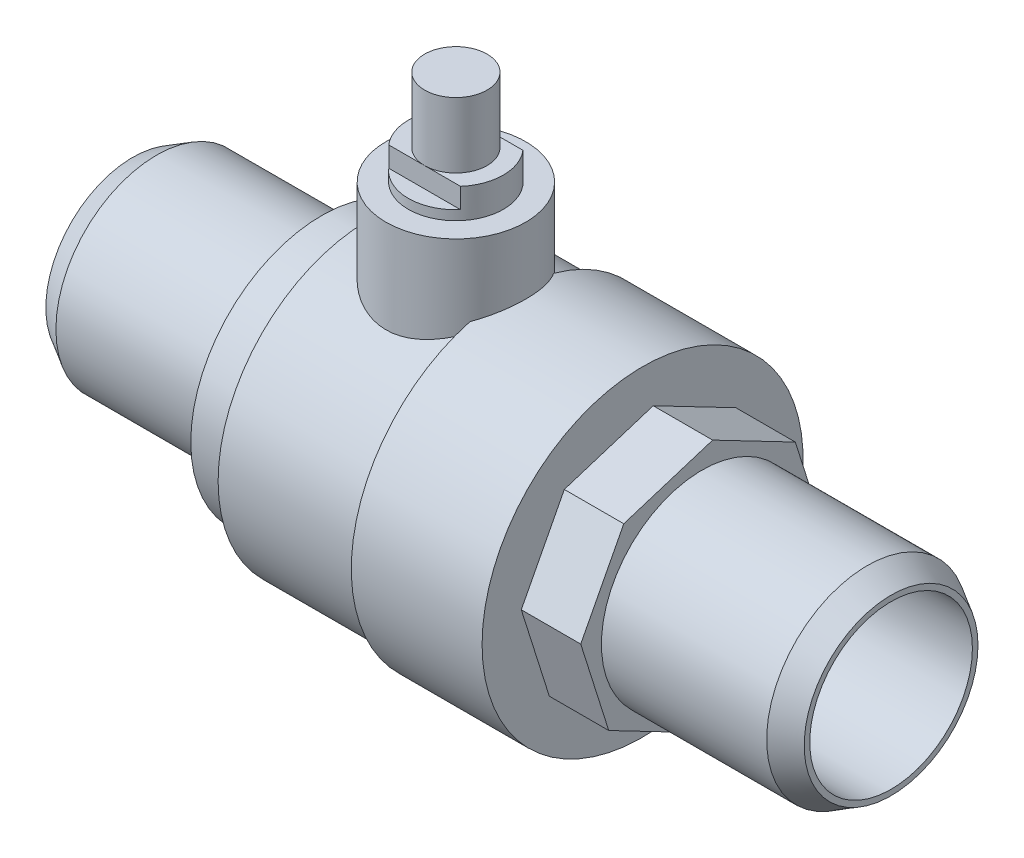
ISO-10303-21;
HEADER;
FILE_DESCRIPTION(('STEP AP214'),'2;1');
FILE_NAME('part.step','',(''),(''),'','','');
FILE_SCHEMA(('AUTOMOTIVE_DESIGN { 1 0 10303 214 1 1 1 1 }'));
ENDSEC;
DATA;
#1=APPLICATION_CONTEXT('core data for automotive mechanical design processes');
#2=APPLICATION_PROTOCOL_DEFINITION('international standard','automotive_design',2000,#1);
#3=PRODUCT_CONTEXT('',#1,'mechanical');
#4=PRODUCT('Part','Part','',(#3));
#5=PRODUCT_RELATED_PRODUCT_CATEGORY('part','',(#4));
#6=PRODUCT_DEFINITION_FORMATION('','',#4);
#7=PRODUCT_DEFINITION_CONTEXT('part definition',#1,'design');
#8=PRODUCT_DEFINITION('design','',#6,#7);
#9=PRODUCT_DEFINITION_SHAPE('','',#8);
#10=(LENGTH_UNIT() NAMED_UNIT(*) SI_UNIT(.MILLI.,.METRE.));
#11=(NAMED_UNIT(*) PLANE_ANGLE_UNIT() SI_UNIT($,.RADIAN.));
#12=(NAMED_UNIT(*) SI_UNIT($,.STERADIAN.) SOLID_ANGLE_UNIT());
#13=UNCERTAINTY_MEASURE_WITH_UNIT(LENGTH_MEASURE(1.E-05),#10,'distance_accuracy_value','');
#14=(GEOMETRIC_REPRESENTATION_CONTEXT(3) GLOBAL_UNCERTAINTY_ASSIGNED_CONTEXT((#13)) GLOBAL_UNIT_ASSIGNED_CONTEXT((#10,
#11,#12)) REPRESENTATION_CONTEXT('',''));
#15=CARTESIAN_POINT('',(0.,0.,0.));
#16=DIRECTION('',(0.,0.,1.));
#17=DIRECTION('',(1.,0.,0.));
#18=AXIS2_PLACEMENT_3D('',#15,#16,#17);
#19=CARTESIAN_POINT('',(-4.715,21.6,0.));
#20=DIRECTION('',(0.,1.,0.));
#21=DIRECTION('',(0.,0.,1.));
#22=AXIS2_PLACEMENT_3D('',#19,#20,#21);
#23=PLANE('',#22);
#24=CARTESIAN_POINT('',(-4.715,21.6,0.));
#25=DIRECTION('',(0.,1.,0.));
#26=DIRECTION('',(0.,0.,1.));
#27=AXIS2_PLACEMENT_3D('',#24,#25,#26);
#28=CIRCLE('',#27,2.625);
#29=CARTESIAN_POINT('',(-4.715,21.6,2.625));
#30=VERTEX_POINT('',#29);
#31=CARTESIAN_POINT('',(-4.715,21.6,-2.625));
#32=VERTEX_POINT('',#31);
#33=EDGE_CURVE('E162',#30,#32,#28,.T.);
#34=ORIENTED_EDGE('',*,*,#33,.F.);
#35=DIRECTION('',(1.,0.,0.));
#36=VECTOR('',#35,1.);
#37=CARTESIAN_POINT('',(-4.715,21.6,2.625));
#38=LINE('',#37,#36);
#39=CARTESIAN_POINT('',(-1.69682588308759,21.6,2.625));
#40=VERTEX_POINT('',#39);
#41=EDGE_CURVE('E148',#30,#40,#38,.T.);
#42=ORIENTED_EDGE('',*,*,#41,.T.);
#43=CARTESIAN_POINT('',(-4.715,21.6,0.));
#44=DIRECTION('',(0.,1.,0.));
#45=DIRECTION('',(0.,0.,1.));
#46=AXIS2_PLACEMENT_3D('',#43,#44,#45);
#47=CIRCLE('',#46,4.);
#48=CARTESIAN_POINT('',(-1.69682588308759,21.6,-2.625));
#49=VERTEX_POINT('',#48);
#50=EDGE_CURVE('E189',#40,#49,#47,.T.);
#51=ORIENTED_EDGE('',*,*,#50,.T.);
#52=DIRECTION('',(-1.,0.,0.));
#53=VECTOR('',#52,1.);
#54=CARTESIAN_POINT('',(-4.715,21.6,-2.625));
#55=LINE('',#54,#53);
#56=EDGE_CURVE('E159',#49,#32,#55,.T.);
#57=ORIENTED_EDGE('',*,*,#56,.T.);
#58=EDGE_LOOP('',(#34,#42,#51,#57));
#59=FACE_BOUND('',#58,.T.);
#60=ADVANCED_FACE('F36',(#59),#23,.T.);
#61=CARTESIAN_POINT('',(-4.715,21.6,0.));
#62=DIRECTION('',(0.,-1.,0.));
#63=DIRECTION('',(0.,0.,-1.));
#64=AXIS2_PLACEMENT_3D('',#61,#62,#63);
#65=CYLINDRICAL_SURFACE('',#64,4.);
#66=CARTESIAN_POINT('',(-4.715,19.1,0.));
#67=DIRECTION('',(0.,1.,0.));
#68=DIRECTION('',(0.,0.,1.));
#69=AXIS2_PLACEMENT_3D('',#66,#67,#68);
#70=CIRCLE('',#69,4.);
#71=CARTESIAN_POINT('',(-4.715,19.1,4.));
#72=VERTEX_POINT('',#71);
#73=EDGE_CURVE('E192',#72,#72,#70,.T.);
#74=ORIENTED_EDGE('',*,*,#73,.T.);
#75=EDGE_LOOP('',(#74));
#76=FACE_BOUND('',#75,.T.);
#77=DIRECTION('',(0.,-1.,0.));
#78=VECTOR('',#77,1.);
#79=CARTESIAN_POINT('',(-7.73317411691241,21.6,2.625));
#80=LINE('',#79,#78);
#81=CARTESIAN_POINT('',(-7.73317411691241,21.6,2.625));
#82=VERTEX_POINT('',#81);
#83=CARTESIAN_POINT('',(-7.73317411691241,19.9,2.625));
#84=VERTEX_POINT('',#83);
#85=EDGE_CURVE('E187',#82,#84,#80,.T.);
#86=ORIENTED_EDGE('',*,*,#85,.F.);
#87=CARTESIAN_POINT('',(-7.73317411691241,21.6,-2.625));
#88=VERTEX_POINT('',#87);
#89=EDGE_CURVE('E144',#88,#82,#47,.T.);
#90=ORIENTED_EDGE('',*,*,#89,.F.);
#91=DIRECTION('',(0.,-1.,0.));
#92=VECTOR('',#91,1.);
#93=CARTESIAN_POINT('',(-7.73317411691241,21.6,-2.625));
#94=LINE('',#93,#92);
#95=CARTESIAN_POINT('',(-7.73317411691241,19.9,-2.625));
#96=VERTEX_POINT('',#95);
#97=EDGE_CURVE('E182',#96,#88,#94,.F.);
#98=ORIENTED_EDGE('',*,*,#97,.F.);
#99=CARTESIAN_POINT('',(-4.715,19.9,0.));
#100=DIRECTION('',(0.,1.,0.));
#101=DIRECTION('',(0.,0.,1.));
#102=AXIS2_PLACEMENT_3D('',#99,#100,#101);
#103=CIRCLE('',#102,4.);
#104=CARTESIAN_POINT('',(-1.69682588308759,19.9,-2.625));
#105=VERTEX_POINT('',#104);
#106=EDGE_CURVE('E147',#105,#96,#103,.T.);
#107=ORIENTED_EDGE('',*,*,#106,.F.);
#108=DIRECTION('',(0.,-1.,0.));
#109=VECTOR('',#108,1.);
#110=CARTESIAN_POINT('',(-1.69682588308759,21.6,-2.625));
#111=LINE('',#110,#109);
#112=EDGE_CURVE('E184',#49,#105,#111,.T.);
#113=ORIENTED_EDGE('',*,*,#112,.F.);
#114=ORIENTED_EDGE('',*,*,#50,.F.);
#115=DIRECTION('',(0.,-1.,0.));
#116=VECTOR('',#115,1.);
#117=CARTESIAN_POINT('',(-1.69682588308759,21.6,2.625));
#118=LINE('',#117,#116);
#119=CARTESIAN_POINT('',(-1.69682588308759,19.9,2.625));
#120=VERTEX_POINT('',#119);
#121=EDGE_CURVE('E155',#120,#40,#118,.F.);
#122=ORIENTED_EDGE('',*,*,#121,.F.);
#123=EDGE_CURVE('E169',#84,#120,#103,.T.);
#124=ORIENTED_EDGE('',*,*,#123,.F.);
#125=EDGE_LOOP('',(#86,#90,#98,#107,#113,#114,#122,#124));
#126=FACE_BOUND('',#125,.T.);
#127=ADVANCED_FACE('F269',(#76,#126),#65,.T.);
#128=EDGE_CURVE('E52',#32,#30,#28,.T.);
#129=ORIENTED_EDGE('',*,*,#128,.F.);
#130=EDGE_CURVE('E56',#32,#88,#55,.T.);
#131=ORIENTED_EDGE('',*,*,#130,.T.);
#132=ORIENTED_EDGE('',*,*,#89,.T.);
#133=EDGE_CURVE('E140',#82,#30,#38,.T.);
#134=ORIENTED_EDGE('',*,*,#133,.T.);
#135=EDGE_LOOP('',(#129,#131,#132,#134));
#136=FACE_BOUND('',#135,.T.);
#137=ADVANCED_FACE('F142',(#136),#23,.T.);
#138=CARTESIAN_POINT('',(-0.00999999999999959,0.,0.));
#139=DIRECTION('',(1.,0.,0.));
#140=DIRECTION('',(0.,0.,-1.));
#141=AXIS2_PLACEMENT_3D('',#138,#139,#140);
#142=CYLINDRICAL_SURFACE('',#141,13.5);
#143=CARTESIAN_POINT('',(10.99,0.,0.));
#144=DIRECTION('',(-1.,0.,0.));
#145=DIRECTION('',(0.,0.,1.));
#146=AXIS2_PLACEMENT_3D('',#143,#144,#145);
#147=CIRCLE('',#146,13.5);
#148=CARTESIAN_POINT('',(10.99,0.,13.5));
#149=VERTEX_POINT('',#148);
#150=EDGE_CURVE('E286',#149,#149,#147,.T.);
#151=ORIENTED_EDGE('',*,*,#150,.T.);
#152=EDGE_LOOP('',(#151));
#153=FACE_BOUND('',#152,.T.);
#154=CARTESIAN_POINT('',(-0.00999999999999959,13.0334722925244,3.51832346437902));
#155=CARTESIAN_POINT('',(0.0842090049769577,13.0674896501867,3.39235443396426));
#156=CARTESIAN_POINT('',(0.173473865123659,13.1005940665465,3.26241761418438));
#157=CARTESIAN_POINT('',(0.341554162434968,13.1642318881376,2.99529103325605));
#158=CARTESIAN_POINT('',(0.42036586790057,13.1947643737967,2.85809870626161));
#159=CARTESIAN_POINT('',(0.567103087805311,13.2525636479501,2.57686594420769));
#160=CARTESIAN_POINT('',(0.634999490305637,13.2798216558372,2.43280848220463));
#161=CARTESIAN_POINT('',(0.759071309045436,13.3302893674388,2.13906108417161));
#162=CARTESIAN_POINT('',(0.81524815683983,13.3534995655403,1.98937183870914));
#163=CARTESIAN_POINT('',(0.915496394897774,13.395326930808,1.6849010459959));
#164=CARTESIAN_POINT('',(0.959534428024665,13.4139314276322,1.53010675008761));
#165=CARTESIAN_POINT('',(1.03484120384337,13.4459616953606,1.21691735286865));
#166=CARTESIAN_POINT('',(1.06611043893269,13.4593876659609,1.05852239065759));
#167=CARTESIAN_POINT('',(1.11548306785242,13.4806680844181,0.739642327041597));
#168=CARTESIAN_POINT('',(1.13361234936406,13.488533486673,0.579161972982386));
#169=CARTESIAN_POINT('',(1.15659240656238,13.4985133973601,0.257079905606061));
#170=CARTESIAN_POINT('',(1.16144393496519,13.500628231792,0.0954782563759108));
#171=CARTESIAN_POINT('',(1.15790310699269,13.4990876113684,-0.219602012561963));
#172=CARTESIAN_POINT('',(1.15014973707764,13.4957105569392,-0.373089634540998));
#173=CARTESIAN_POINT('',(1.1226671805155,13.4837895089721,-0.678849620625366));
#174=CARTESIAN_POINT('',(1.10293311034488,13.4752434084543,-0.831121463503043));
#175=CARTESIAN_POINT('',(1.05165475173216,13.4531835037983,-1.13352204801818));
#176=CARTESIAN_POINT('',(1.02009338271723,13.4396625156158,-1.28364736261266));
#177=CARTESIAN_POINT('',(0.945478445409897,13.4079920800935,-1.58051791025914));
#178=CARTESIAN_POINT('',(0.902424221982664,13.3898423689023,-1.7272629501049));
#179=CARTESIAN_POINT('',(0.803820397667253,13.3487709561276,-2.02061314076969));
#180=CARTESIAN_POINT('',(0.747945719761866,13.3257265326326,-2.16709175484948));
#181=CARTESIAN_POINT('',(0.624952698662875,13.2757793315217,-2.45458388963828));
#182=CARTESIAN_POINT('',(0.557832788991176,13.2488760164313,-2.59559664557027));
#183=CARTESIAN_POINT('',(0.413061355079574,13.1919276596294,-2.87102032870646));
#184=CARTESIAN_POINT('',(0.335433638681942,13.1618897543109,-3.00544527043807));
#185=CARTESIAN_POINT('',(0.170121600484586,13.0993508461218,-3.26729273426234));
#186=CARTESIAN_POINT('',(0.0824408978463979,13.0668507310885,-3.39471775210353));
#187=CARTESIAN_POINT('',(-0.00999999999999942,13.0334722925244,-3.51832346437902));
#188=B_SPLINE_CURVE_WITH_KNOTS('',3,(#154,#155,#156,#157,#158,#159,#160,#161,#162,#163,#164,
#165,#166,#167,#168,#169,#170,#171,#172,#173,#174,#175,#176,#177,#178,#179,#180,#181,#182,#183,
#184,#185,#186,#187),.UNSPECIFIED.,.F.,.F.,(4,2,2,2,2,2,2,2,2,2,2,2,2,2,2,2,4),(0.,
0.482712728291856,0.965597320284249,1.44974916919056,1.93384184380876,2.41925182283332,
2.9046430814395,3.389075427539,3.8734803105891,4.33408544035974,4.79487844626508,
5.25633949410212,5.71782685252939,6.19264750298032,6.66753435175786,7.14136270440398,
7.61502100723786),.UNSPECIFIED.);
#189=CARTESIAN_POINT('',(-0.00999999999999959,13.0334722925244,3.51832346437902));
#190=VERTEX_POINT('',#189);
#191=CARTESIAN_POINT('',(-0.00999999999999959,13.0334722925244,-3.51832346437902));
#192=VERTEX_POINT('',#191);
#193=EDGE_CURVE('E203',#190,#192,#188,.T.);
#194=ORIENTED_EDGE('',*,*,#193,.F.);
#195=CARTESIAN_POINT('',(-0.00999999999999959,0.,0.));
#196=DIRECTION('',(-1.,0.,0.));
#197=DIRECTION('',(0.,0.,1.));
#198=AXIS2_PLACEMENT_3D('',#195,#196,#197);
#199=CIRCLE('',#198,13.5);
#200=EDGE_CURVE('E289',#192,#190,#199,.T.);
#201=ORIENTED_EDGE('',*,*,#200,.F.);
#202=EDGE_LOOP('',(#194,#201));
#203=FACE_BOUND('',#202,.T.);
#204=ADVANCED_FACE('F215',(#153,#203),#142,.T.);
#205=CARTESIAN_POINT('',(-0.00999999999999959,0.,0.));
#206=DIRECTION('',(-1.,0.,0.));
#207=DIRECTION('',(0.,0.,1.));
#208=AXIS2_PLACEMENT_3D('',#205,#206,#207);
#209=PLANE('',#208);
#210=CARTESIAN_POINT('',(-0.00999999999999959,0.,0.));
#211=DIRECTION('',(-1.,0.,0.));
#212=DIRECTION('',(0.,0.,1.));
#213=AXIS2_PLACEMENT_3D('',#210,#211,#212);
#214=CIRCLE('',#213,12.7);
#215=CARTESIAN_POINT('',(-0.00999999999999959,12.2029258786571,-3.51832346437902));
#216=VERTEX_POINT('',#215);
#217=CARTESIAN_POINT('',(-0.00999999999999959,12.2029258786571,3.51832346437902));
#218=VERTEX_POINT('',#217);
#219=EDGE_CURVE('E297',#216,#218,#214,.T.);
#220=ORIENTED_EDGE('',*,*,#219,.F.);
#221=DIRECTION('',(0.,-1.,0.));
#222=VECTOR('',#221,1.);
#223=CARTESIAN_POINT('',(-0.00999999999999959,19.1,-3.51832346437902));
#224=LINE('',#223,#222);
#225=EDGE_CURVE('E201',#216,#192,#224,.F.);
#226=ORIENTED_EDGE('',*,*,#225,.T.);
#227=ORIENTED_EDGE('',*,*,#200,.T.);
#228=DIRECTION('',(0.,-1.,0.));
#229=VECTOR('',#228,1.);
#230=CARTESIAN_POINT('',(-0.00999999999999959,19.1,3.51832346437902));
#231=LINE('',#230,#229);
#232=EDGE_CURVE('E198',#190,#218,#231,.T.);
#233=ORIENTED_EDGE('',*,*,#232,.T.);
#234=EDGE_LOOP('',(#220,#226,#227,#233));
#235=FACE_BOUND('',#234,.T.);
#236=ADVANCED_FACE('F249',(#235),#209,.T.);
#237=CARTESIAN_POINT('',(-12.01,0.,0.));
#238=DIRECTION('',(1.,0.,0.));
#239=DIRECTION('',(0.,0.,-1.));
#240=AXIS2_PLACEMENT_3D('',#237,#238,#239);
#241=CYLINDRICAL_SURFACE('',#240,12.7);
#242=CARTESIAN_POINT('',(-12.01,0.,0.));
#243=DIRECTION('',(-1.,0.,0.));
#244=DIRECTION('',(0.,0.,1.));
#245=AXIS2_PLACEMENT_3D('',#242,#243,#244);
#246=CIRCLE('',#245,12.7);
#247=CARTESIAN_POINT('',(-12.01,0.,12.7));
#248=VERTEX_POINT('',#247);
#249=EDGE_CURVE('E298',#248,#248,#246,.T.);
#250=ORIENTED_EDGE('',*,*,#249,.F.);
#251=EDGE_LOOP('',(#250));
#252=FACE_BOUND('',#251,.T.);
#253=CARTESIAN_POINT('',(-0.00999999999999959,12.2029258786571,-3.51832346437902));
#254=CARTESIAN_POINT('',(-0.110548594807292,12.1641669182533,-3.65277213936879));
#255=CARTESIAN_POINT('',(-0.216642378817668,12.1243094096603,-3.78264458001596));
#256=CARTESIAN_POINT('',(-0.439337427258175,12.043456940642,-4.03266537142814));
#257=CARTESIAN_POINT('',(-0.555938711979185,12.0024619780203,-4.15281370341421));
#258=CARTESIAN_POINT('',(-0.92129120792452,11.8791370369348,-4.49844094417245));
#259=CARTESIAN_POINT('',(-1.18503699789073,11.7966897370434,-4.70836314660586));
#260=CARTESIAN_POINT('',(-1.74691591942007,11.6409320836049,-5.08131937956054));
#261=CARTESIAN_POINT('',(-2.04508908644483,11.5676325782703,-5.24429803441645));
#262=CARTESIAN_POINT('',(-2.51207556840235,11.4718766264648,-5.44900716313044));
#263=CARTESIAN_POINT('',(-2.67096699235351,11.4423313162767,-5.5106025856715));
#264=CARTESIAN_POINT('',(-2.99441727952624,11.3890031075838,-5.61999346422932));
#265=CARTESIAN_POINT('',(-3.15897567443825,11.3652197342205,-5.66779005751119));
#266=CARTESIAN_POINT('',(-3.48330339845309,11.3255010002015,-5.74672696052976));
#267=CARTESIAN_POINT('',(-3.64284248597849,11.3092075827731,-5.77863521017378));
#268=CARTESIAN_POINT('',(-3.96454431885749,11.2832561801997,-5.82914585007749));
#269=CARTESIAN_POINT('',(-4.12670681215733,11.2735975614212,-5.84774951095316));
#270=CARTESIAN_POINT('',(-4.45224692748032,11.2613038081456,-5.87138954715816));
#271=CARTESIAN_POINT('',(-4.61562426368574,11.2586670709531,-5.87642901842208));
#272=CARTESIAN_POINT('',(-4.94218439611731,11.2605210819185,-5.87287585237765));
#273=CARTESIAN_POINT('',(-5.10536720377793,11.2650113881409,-5.86428406032039));
#274=CARTESIAN_POINT('',(-5.41485193702559,11.2801843194109,-5.83503878693275));
#275=CARTESIAN_POINT('',(-5.56130061155865,11.2902461244553,-5.81559320542977));
#276=CARTESIAN_POINT('',(-5.85190820158059,11.3157401889006,-5.76583083509889));
#277=CARTESIAN_POINT('',(-5.99606638245782,11.3311741363078,-5.73551062921266));
#278=CARTESIAN_POINT('',(-6.28109832773566,11.3669281386523,-5.66432064658729));
#279=CARTESIAN_POINT('',(-6.4219728438453,11.3872470630087,-5.62345331071901));
#280=CARTESIAN_POINT('',(-6.69968355728552,11.4321706981511,-5.53155332482791));
#281=CARTESIAN_POINT('',(-6.8365181614466,11.4567770740072,-5.48051672437029));
#282=CARTESIAN_POINT('',(-7.24873220968141,11.5377725260792,-5.30906523044976));
#283=CARTESIAN_POINT('',(-7.51648602828107,11.6001044310782,-5.17264292370361));
#284=CARTESIAN_POINT('',(-8.02647768569675,11.733687054927,-4.86200579029639));
#285=CARTESIAN_POINT('',(-8.26870337651138,11.804941984976,-4.68777309046908));
#286=CARTESIAN_POINT('',(-8.74790880011808,11.9575002579965,-4.28478547361512));
#287=CARTESIAN_POINT('',(-8.98159890584744,12.0390670460731,-4.05220519150853));
#288=CARTESIAN_POINT('',(-9.40777799168936,12.1966077819357,-3.54990409003812));
#289=CARTESIAN_POINT('',(-9.60025518313359,12.2725801254034,-3.28017268001098));
#290=CARTESIAN_POINT('',(-9.85585816452821,12.3772616839151,-2.84889148483661));
#291=CARTESIAN_POINT('',(-9.93634112564312,12.4109755823173,-2.69859550005496));
#292=CARTESIAN_POINT('',(-10.0842344704794,12.4739152446686,-2.3908257418733));
#293=CARTESIAN_POINT('',(-10.1516504077337,12.5031429141773,-2.2333550530485));
#294=CARTESIAN_POINT('',(-10.2726799013604,12.5562425330116,-1.91238988155526));
#295=CARTESIAN_POINT('',(-10.3262983661599,12.5801163865583,-1.74889756479732));
#296=CARTESIAN_POINT('',(-10.419126991878,12.6217952678041,-1.41711711757746));
#297=CARTESIAN_POINT('',(-10.4583385615476,12.6396008888614,-1.2488294577541));
#298=CARTESIAN_POINT('',(-10.5193516181522,12.6674464091839,-0.922238093812368));
#299=CARTESIAN_POINT('',(-10.5422770977891,12.6779857235478,-0.764186122953552));
#300=CARTESIAN_POINT('',(-10.5751875946665,12.6931461183262,-0.446462076686936));
#301=CARTESIAN_POINT('',(-10.5851734740665,12.6977675930431,-0.286790109933228));
#302=CARTESIAN_POINT('',(-10.5920821846774,12.7009629955518,0.0328521465153815));
#303=CARTESIAN_POINT('',(-10.589008568495,12.6995385680251,0.192822343247483));
#304=CARTESIAN_POINT('',(-10.5698444140534,12.6906857769125,0.511810691635123));
#305=CARTESIAN_POINT('',(-10.5537542036093,12.6832575645282,0.670828867165139));
#306=CARTESIAN_POINT('',(-10.5100774233596,12.6632123380329,0.977366818647544));
#307=CARTESIAN_POINT('',(-10.4832218749976,12.6509258384536,1.12501322469448));
#308=CARTESIAN_POINT('',(-10.4184216176295,12.6215118046091,1.41740601336874));
#309=CARTESIAN_POINT('',(-10.3804733409434,12.6043827129118,1.56215144694631));
#310=CARTESIAN_POINT('',(-10.2938619449516,12.5656903109779,1.84774942934955));
#311=CARTESIAN_POINT('',(-10.2452018185142,12.5441282394177,1.988603053191));
#312=CARTESIAN_POINT('',(-10.1375930787599,12.4970621490617,2.26566350672443));
#313=CARTESIAN_POINT('',(-10.0786405346506,12.4715566246435,2.40186853721995));
#314=CARTESIAN_POINT('',(-9.88227500452301,12.387922880138,2.81228645554904));
#315=CARTESIAN_POINT('',(-9.72854698255835,12.3241554098885,3.07776739837333));
#316=CARTESIAN_POINT('',(-9.38316358516594,12.1877400609405,3.58008365683265));
#317=CARTESIAN_POINT('',(-9.19149028150075,12.1150879907079,3.81690534610461));
#318=CARTESIAN_POINT('',(-8.75630325734514,11.9608338576033,4.27694318001063));
#319=CARTESIAN_POINT('',(-8.50973624991333,11.8790018519769,4.49720100086377));
#320=CARTESIAN_POINT('',(-7.98171014490996,11.7210304653922,4.89420329863303));
#321=CARTESIAN_POINT('',(-7.70023811277061,11.644893211563,5.07093157215979));
#322=CARTESIAN_POINT('',(-7.25351509110038,11.5410891150359,5.30099584811714));
#323=CARTESIAN_POINT('',(-7.09863458002546,11.5079093891222,5.3724433074084));
#324=CARTESIAN_POINT('',(-6.78240714776984,11.4465950147602,5.50187173196402));
#325=CARTESIAN_POINT('',(-6.6210632317816,11.4184580542126,5.55985887238054));
#326=CARTESIAN_POINT('',(-6.29316299139642,11.3683217174898,5.66166810160396));
#327=CARTESIAN_POINT('',(-6.12661037462577,11.3463180813549,5.7055000254257));
#328=CARTESIAN_POINT('',(-5.78955165195329,11.3093324638404,5.77846698869224));
#329=CARTESIAN_POINT('',(-5.61904605574269,11.2943495824415,5.80760391198569));
#330=CARTESIAN_POINT('',(-5.29190233257844,11.2731147810217,5.84870590917405));
#331=CARTESIAN_POINT('',(-5.13547920924476,11.2661706808917,5.86203531263849));
#332=CARTESIAN_POINT('',(-4.82191790389993,11.2588298238195,5.87612264701364));
#333=CARTESIAN_POINT('',(-4.66477977035226,11.2584326295496,5.87688141763175));
#334=CARTESIAN_POINT('',(-4.35110615396652,11.2642002198278,5.86581884818598));
#335=CARTESIAN_POINT('',(-4.19457054516198,11.2703635485916,5.85400029903775));
#336=CARTESIAN_POINT('',(-3.88332452442537,11.2890178203491,5.81794522247268));
#337=CARTESIAN_POINT('',(-3.72861408777031,11.3015086775318,5.79370886346023));
#338=CARTESIAN_POINT('',(-3.43172647513095,11.331404617106,5.73500489372633));
#339=CARTESIAN_POINT('',(-3.28936848861577,11.348455508929,5.70126784433861));
#340=CARTESIAN_POINT('',(-3.00813093984259,11.3872006243346,5.62348116776925));
#341=CARTESIAN_POINT('',(-2.86925251884765,11.4088963496709,5.57942820484418));
#342=CARTESIAN_POINT('',(-2.45896443676238,11.4800570025296,5.43233118417317));
#343=CARTESIAN_POINT('',(-2.19380823504494,11.5356054859228,5.31433021199796));
#344=CARTESIAN_POINT('',(-1.6667836994771,11.6617096659649,5.03190981101949));
#345=CARTESIAN_POINT('',(-1.40663054318904,11.7330748635965,4.86468812066842));
#346=CARTESIAN_POINT('',(-0.916654725284463,11.8805418489912,4.49250729679264));
#347=CARTESIAN_POINT('',(-0.686802273946978,11.9566388747208,4.28758570958433));
#348=CARTESIAN_POINT('',(-0.39147734977002,12.06073017473,3.97959137543051));
#349=CARTESIAN_POINT('',(-0.31125683674088,12.0897531013179,3.89063660391235));
#350=CARTESIAN_POINT('',(-0.156422671064307,12.1470100600574,3.70800219007176));
#351=CARTESIAN_POINT('',(-0.0817999481568919,12.1752453197137,3.61433062105158));
#352=CARTESIAN_POINT('',(-0.00999999999999946,12.2029258786571,3.51832346437902));
#353=B_SPLINE_CURVE_WITH_KNOTS('',3,(#253,#254,#255,#256,#257,#258,#259,#260,#261,#262,#263,
#264,#265,#266,#267,#268,#269,#270,#271,#272,#273,#274,#275,#276,#277,#278,#279,#280,#281,#282,
#283,#284,#285,#286,#287,#288,#289,#290,#291,#292,#293,#294,#295,#296,#297,#298,#299,#300,#301,
#302,#303,#304,#305,#306,#307,#308,#309,#310,#311,#312,#313,#314,#315,#316,#317,#318,#319,#320,
#321,#322,#323,#324,#325,#326,#327,#328,#329,#330,#331,#332,#333,#334,#335,#336,#337,#338,#339,
#340,#341,#342,#343,#344,#345,#346,#347,#348,#349,#350,#351,#352),.UNSPECIFIED.,.F.,.F.,(4,2,2,
2,2,2,2,2,2,2,2,2,2,2,2,2,2,2,2,2,2,2,2,2,2,2,2,2,2,2,2,2,2,2,2,2,2,2,2,2,2,2,2,2,2,2,2,2,2,4),
(0.,0.516592293553117,1.0331855847113,2.06918690772539,3.10640536261012,3.62465522050059,
4.14286235332831,4.63273022604506,5.1225513091084,5.61226058433614,6.10193949472437,
6.54565361302726,6.98950727888969,7.43325831782873,7.87718207715177,8.79381103837369,
9.71087424230571,10.7253389139845,11.740093379735,12.260883643091,12.7814520810078,
13.3018350707706,13.8221671623128,14.3017025157845,14.7812059164,15.2605788848842,
15.7399397810258,16.1911355760262,16.6424766460771,17.0936917720721,17.5450796007793,
18.4807994731514,19.4169625104686,20.4342662301985,21.4519480595571,21.9726452005583,
22.4931029886075,23.0131983817694,23.5332270835281,24.004033251951,24.4748079708024,
24.9454782462077,25.4161421387778,25.8575161386548,26.2990330583477,27.1817817881657,
28.1302653459785,29.0778093481246,29.4473870359107,29.8163523369486),.UNSPECIFIED.);
#354=EDGE_CURVE('E195',#216,#218,#353,.T.);
#355=ORIENTED_EDGE('',*,*,#354,.F.);
#356=ORIENTED_EDGE('',*,*,#219,.T.);
#357=EDGE_LOOP('',(#355,#356));
#358=FACE_BOUND('',#357,.T.);
#359=ADVANCED_FACE('F243',(#252,#358),#241,.T.);
#360=CARTESIAN_POINT('',(10.99,-0.892566650724965,-10.2020835014871));
#361=DIRECTION('',(0.,0.300705799504275,-0.953716950748226));
#362=DIRECTION('',(0.,0.953716950748226,0.300705799504275));
#363=AXIS2_PLACEMENT_3D('',#360,#361,#362);
#364=PLANE('',#363);
#365=DIRECTION('',(0.,0.953716950748226,0.300705799504275));
#366=VECTOR('',#365,1.);
#367=CARTESIAN_POINT('',(15.99,-0.892566650724965,-10.2020835014871));
#368=LINE('',#367,#366);
#369=CARTESIAN_POINT('',(15.99,-0.892566650724965,-10.2020835014871));
#370=VERTEX_POINT('',#369);
#371=CARTESIAN_POINT('',(15.99,6.58282249474435,-7.84510235752153));
#372=VERTEX_POINT('',#371);
#373=EDGE_CURVE('E294',#370,#372,#368,.T.);
#374=ORIENTED_EDGE('',*,*,#373,.F.);
#375=DIRECTION('',(1.,0.,0.));
#376=VECTOR('',#375,1.);
#377=CARTESIAN_POINT('',(10.99,-0.892566650724965,-10.2020835014871));
#378=LINE('',#377,#376);
#379=CARTESIAN_POINT('',(10.99,-0.892566650724965,-10.2020835014871));
#380=VERTEX_POINT('',#379);
#381=EDGE_CURVE('E353',#380,#370,#378,.T.);
#382=ORIENTED_EDGE('',*,*,#381,.F.);
#383=DIRECTION('',(0.,0.953716950748226,0.300705799504275));
#384=VECTOR('',#383,1.);
#385=CARTESIAN_POINT('',(10.99,-0.892566650724965,-10.2020835014871));
#386=LINE('',#385,#384);
#387=CARTESIAN_POINT('',(10.99,6.58282249474435,-7.84510235752153));
#388=VERTEX_POINT('',#387);
#389=EDGE_CURVE('E305',#380,#388,#386,.T.);
#390=ORIENTED_EDGE('',*,*,#389,.T.);
#391=DIRECTION('',(1.,0.,0.));
#392=VECTOR('',#391,1.);
#393=CARTESIAN_POINT('',(10.99,6.58282249474435,-7.84510235752153));
#394=LINE('',#393,#392);
#395=EDGE_CURVE('E330',#388,#372,#394,.T.);
#396=ORIENTED_EDGE('',*,*,#395,.T.);
#397=EDGE_LOOP('',(#374,#382,#390,#396));
#398=FACE_BOUND('',#397,.T.);
#399=ADVANCED_FACE('F248',(#398),#364,.T.);
#400=CARTESIAN_POINT('',(10.99,-7.84510235752152,-6.58282249474435));
#401=DIRECTION('',(0.,-0.461748613235032,-0.887010833178223));
#402=DIRECTION('',(0.,0.887010833178223,-0.461748613235032));
#403=AXIS2_PLACEMENT_3D('',#400,#401,#402);
#404=PLANE('',#403);
#405=DIRECTION('',(0.,0.887010833178223,-0.461748613235032));
#406=VECTOR('',#405,1.);
#407=CARTESIAN_POINT('',(15.99,-7.84510235752152,-6.58282249474435));
#408=LINE('',#407,#406);
#409=CARTESIAN_POINT('',(15.99,-7.84510235752152,-6.58282249474435));
#410=VERTEX_POINT('',#409);
#411=EDGE_CURVE('E309',#410,#370,#408,.T.);
#412=ORIENTED_EDGE('',*,*,#411,.F.);
#413=DIRECTION('',(1.,0.,0.));
#414=VECTOR('',#413,1.);
#415=CARTESIAN_POINT('',(10.99,-7.84510235752152,-6.58282249474435));
#416=LINE('',#415,#414);
#417=CARTESIAN_POINT('',(10.99,-7.84510235752152,-6.58282249474435));
#418=VERTEX_POINT('',#417);
#419=EDGE_CURVE('E355',#418,#410,#416,.T.);
#420=ORIENTED_EDGE('',*,*,#419,.F.);
#421=DIRECTION('',(0.,0.887010833178223,-0.461748613235032));
#422=VECTOR('',#421,1.);
#423=CARTESIAN_POINT('',(10.99,-7.84510235752152,-6.58282249474435));
#424=LINE('',#423,#422);
#425=EDGE_CURVE('E327',#418,#380,#424,.T.);
#426=ORIENTED_EDGE('',*,*,#425,.T.);
#427=ORIENTED_EDGE('',*,*,#381,.T.);
#428=EDGE_LOOP('',(#412,#420,#426,#427));
#429=FACE_BOUND('',#428,.T.);
#430=ADVANCED_FACE('F403',(#429),#404,.T.);
#431=CARTESIAN_POINT('',(10.99,-10.2020835014871,0.892566650724967));
#432=DIRECTION('',(0.,-0.953716950748226,-0.300705799504275));
#433=DIRECTION('',(0.,0.300705799504275,-0.953716950748226));
#434=AXIS2_PLACEMENT_3D('',#431,#432,#433);
#435=PLANE('',#434);
#436=DIRECTION('',(0.,0.300705799504275,-0.953716950748226));
#437=VECTOR('',#436,1.);
#438=CARTESIAN_POINT('',(15.99,-10.2020835014871,0.892566650724967));
#439=LINE('',#438,#437);
#440=CARTESIAN_POINT('',(15.99,-10.2020835014871,0.892566650724967));
#441=VERTEX_POINT('',#440);
#442=EDGE_CURVE('E348',#441,#410,#439,.T.);
#443=ORIENTED_EDGE('',*,*,#442,.F.);
#444=DIRECTION('',(1.,0.,0.));
#445=VECTOR('',#444,1.);
#446=CARTESIAN_POINT('',(10.99,-10.2020835014871,0.892566650724967));
#447=LINE('',#446,#445);
#448=CARTESIAN_POINT('',(10.99,-10.2020835014871,0.892566650724967));
#449=VERTEX_POINT('',#448);
#450=EDGE_CURVE('E357',#449,#441,#447,.T.);
#451=ORIENTED_EDGE('',*,*,#450,.F.);
#452=DIRECTION('',(0.,0.300705799504275,-0.953716950748226));
#453=VECTOR('',#452,1.);
#454=CARTESIAN_POINT('',(10.99,-10.2020835014871,0.892566650724967));
#455=LINE('',#454,#453);
#456=EDGE_CURVE('E324',#449,#418,#455,.T.);
#457=ORIENTED_EDGE('',*,*,#456,.T.);
#458=ORIENTED_EDGE('',*,*,#419,.T.);
#459=EDGE_LOOP('',(#443,#451,#457,#458));
#460=FACE_BOUND('',#459,.T.);
#461=ADVANCED_FACE('F404',(#460),#435,.T.);
#462=CARTESIAN_POINT('',(10.99,-6.58282249474435,7.84510235752152));
#463=DIRECTION('',(0.,-0.887010833178223,0.461748613235032));
#464=DIRECTION('',(0.,-0.461748613235032,-0.887010833178223));
#465=AXIS2_PLACEMENT_3D('',#462,#463,#464);
#466=PLANE('',#465);
#467=DIRECTION('',(0.,-0.461748613235032,-0.887010833178223));
#468=VECTOR('',#467,1.);
#469=CARTESIAN_POINT('',(15.99,-6.58282249474435,7.84510235752152));
#470=LINE('',#469,#468);
#471=CARTESIAN_POINT('',(15.99,-6.58282249474435,7.84510235752152));
#472=VERTEX_POINT('',#471);
#473=EDGE_CURVE('E345',#472,#441,#470,.T.);
#474=ORIENTED_EDGE('',*,*,#473,.F.);
#475=DIRECTION('',(1.,0.,0.));
#476=VECTOR('',#475,1.);
#477=CARTESIAN_POINT('',(10.99,-6.58282249474435,7.84510235752152));
#478=LINE('',#477,#476);
#479=CARTESIAN_POINT('',(10.99,-6.58282249474435,7.84510235752152));
#480=VERTEX_POINT('',#479);
#481=EDGE_CURVE('E359',#480,#472,#478,.T.);
#482=ORIENTED_EDGE('',*,*,#481,.F.);
#483=DIRECTION('',(0.,-0.461748613235032,-0.887010833178223));
#484=VECTOR('',#483,1.);
#485=CARTESIAN_POINT('',(10.99,-6.58282249474435,7.84510235752152));
#486=LINE('',#485,#484);
#487=EDGE_CURVE('E321',#480,#449,#486,.T.);
#488=ORIENTED_EDGE('',*,*,#487,.T.);
#489=ORIENTED_EDGE('',*,*,#450,.T.);
#490=EDGE_LOOP('',(#474,#482,#488,#489));
#491=FACE_BOUND('',#490,.T.);
#492=ADVANCED_FACE('F397',(#491),#466,.T.);
#493=CARTESIAN_POINT('',(10.99,0.892566650724966,10.2020835014871));
#494=DIRECTION('',(0.,-0.300705799504275,0.953716950748226));
#495=DIRECTION('',(0.,-0.953716950748226,-0.300705799504275));
#496=AXIS2_PLACEMENT_3D('',#493,#494,#495);
#497=PLANE('',#496);
#498=DIRECTION('',(0.,-0.953716950748226,-0.300705799504275));
#499=VECTOR('',#498,1.);
#500=CARTESIAN_POINT('',(15.99,0.892566650724966,10.2020835014871));
#501=LINE('',#500,#499);
#502=CARTESIAN_POINT('',(15.99,0.892566650724966,10.2020835014871));
#503=VERTEX_POINT('',#502);
#504=EDGE_CURVE('E342',#503,#472,#501,.T.);
#505=ORIENTED_EDGE('',*,*,#504,.F.);
#506=DIRECTION('',(1.,0.,0.));
#507=VECTOR('',#506,1.);
#508=CARTESIAN_POINT('',(10.99,0.892566650724966,10.2020835014871));
#509=LINE('',#508,#507);
#510=CARTESIAN_POINT('',(10.99,0.892566650724966,10.2020835014871));
#511=VERTEX_POINT('',#510);
#512=EDGE_CURVE('E361',#511,#503,#509,.T.);
#513=ORIENTED_EDGE('',*,*,#512,.F.);
#514=DIRECTION('',(0.,-0.953716950748226,-0.300705799504275));
#515=VECTOR('',#514,1.);
#516=CARTESIAN_POINT('',(10.99,0.892566650724966,10.2020835014871));
#517=LINE('',#516,#515);
#518=EDGE_CURVE('E318',#511,#480,#517,.T.);
#519=ORIENTED_EDGE('',*,*,#518,.T.);
#520=ORIENTED_EDGE('',*,*,#481,.T.);
#521=EDGE_LOOP('',(#505,#513,#519,#520));
#522=FACE_BOUND('',#521,.T.);
#523=ADVANCED_FACE('F393',(#522),#497,.T.);
#524=CARTESIAN_POINT('',(10.99,7.84510235752152,6.58282249474435));
#525=DIRECTION('',(0.,0.461748613235032,0.887010833178223));
#526=DIRECTION('',(0.,-0.887010833178223,0.461748613235032));
#527=AXIS2_PLACEMENT_3D('',#524,#525,#526);
#528=PLANE('',#527);
#529=DIRECTION('',(0.,-0.887010833178223,0.461748613235032));
#530=VECTOR('',#529,1.);
#531=CARTESIAN_POINT('',(15.99,7.84510235752152,6.58282249474435));
#532=LINE('',#531,#530);
#533=CARTESIAN_POINT('',(15.99,7.84510235752152,6.58282249474435));
#534=VERTEX_POINT('',#533);
#535=EDGE_CURVE('E339',#534,#503,#532,.T.);
#536=ORIENTED_EDGE('',*,*,#535,.F.);
#537=DIRECTION('',(1.,0.,0.));
#538=VECTOR('',#537,1.);
#539=CARTESIAN_POINT('',(10.99,7.84510235752152,6.58282249474435));
#540=LINE('',#539,#538);
#541=CARTESIAN_POINT('',(10.99,7.84510235752152,6.58282249474435));
#542=VERTEX_POINT('',#541);
#543=EDGE_CURVE('E363',#542,#534,#540,.T.);
#544=ORIENTED_EDGE('',*,*,#543,.F.);
#545=DIRECTION('',(0.,-0.887010833178223,0.461748613235032));
#546=VECTOR('',#545,1.);
#547=CARTESIAN_POINT('',(10.99,7.84510235752152,6.58282249474435));
#548=LINE('',#547,#546);
#549=EDGE_CURVE('E315',#542,#511,#548,.T.);
#550=ORIENTED_EDGE('',*,*,#549,.T.);
#551=ORIENTED_EDGE('',*,*,#512,.T.);
#552=EDGE_LOOP('',(#536,#544,#550,#551));
#553=FACE_BOUND('',#552,.T.);
#554=ADVANCED_FACE('F390',(#553),#528,.T.);
#555=CARTESIAN_POINT('',(10.99,10.2020835014871,-0.892566650724967));
#556=DIRECTION('',(0.,0.953716950748226,0.300705799504275));
#557=DIRECTION('',(0.,-0.300705799504275,0.953716950748226));
#558=AXIS2_PLACEMENT_3D('',#555,#556,#557);
#559=PLANE('',#558);
#560=DIRECTION('',(0.,-0.300705799504275,0.953716950748226));
#561=VECTOR('',#560,1.);
#562=CARTESIAN_POINT('',(15.99,10.2020835014871,-0.892566650724967));
#563=LINE('',#562,#561);
#564=CARTESIAN_POINT('',(15.99,10.2020835014871,-0.892566650724967));
#565=VERTEX_POINT('',#564);
#566=EDGE_CURVE('E336',#565,#534,#563,.T.);
#567=ORIENTED_EDGE('',*,*,#566,.F.);
#568=DIRECTION('',(1.,0.,0.));
#569=VECTOR('',#568,1.);
#570=CARTESIAN_POINT('',(10.99,10.2020835014871,-0.892566650724967));
#571=LINE('',#570,#569);
#572=CARTESIAN_POINT('',(10.99,10.2020835014871,-0.892566650724967));
#573=VERTEX_POINT('',#572);
#574=EDGE_CURVE('E365',#573,#565,#571,.T.);
#575=ORIENTED_EDGE('',*,*,#574,.F.);
#576=DIRECTION('',(0.,-0.300705799504275,0.953716950748226));
#577=VECTOR('',#576,1.);
#578=CARTESIAN_POINT('',(10.99,10.2020835014871,-0.892566650724967));
#579=LINE('',#578,#577);
#580=EDGE_CURVE('E312',#573,#542,#579,.T.);
#581=ORIENTED_EDGE('',*,*,#580,.T.);
#582=ORIENTED_EDGE('',*,*,#543,.T.);
#583=EDGE_LOOP('',(#567,#575,#581,#582));
#584=FACE_BOUND('',#583,.T.);
#585=ADVANCED_FACE('F385',(#584),#559,.T.);
#586=CARTESIAN_POINT('',(10.99,6.58282249474435,-7.84510235752153));
#587=DIRECTION('',(0.,0.887010833178223,-0.461748613235032));
#588=DIRECTION('',(0.,0.461748613235032,0.887010833178223));
#589=AXIS2_PLACEMENT_3D('',#586,#587,#588);
#590=PLANE('',#589);
#591=DIRECTION('',(0.,0.461748613235032,0.887010833178223));
#592=VECTOR('',#591,1.);
#593=CARTESIAN_POINT('',(15.99,6.58282249474435,-7.84510235752153));
#594=LINE('',#593,#592);
#595=EDGE_CURVE('E333',#372,#565,#594,.T.);
#596=ORIENTED_EDGE('',*,*,#595,.F.);
#597=ORIENTED_EDGE('',*,*,#395,.F.);
#598=DIRECTION('',(0.,0.461748613235032,0.887010833178223));
#599=VECTOR('',#598,1.);
#600=CARTESIAN_POINT('',(10.99,6.58282249474435,-7.84510235752153));
#601=LINE('',#600,#599);
#602=EDGE_CURVE('E308',#388,#573,#601,.T.);
#603=ORIENTED_EDGE('',*,*,#602,.T.);
#604=ORIENTED_EDGE('',*,*,#574,.T.);
#605=EDGE_LOOP('',(#596,#597,#603,#604));
#606=FACE_BOUND('',#605,.T.);
#607=ADVANCED_FACE('F374',(#606),#590,.T.);
#608=CARTESIAN_POINT('',(15.99,0.,0.));
#609=DIRECTION('',(1.,0.,0.));
#610=DIRECTION('',(0.,0.,-1.));
#611=AXIS2_PLACEMENT_3D('',#608,#609,#610);
#612=PLANE('',#611);
#613=CARTESIAN_POINT('',(15.99,0.,0.));
#614=DIRECTION('',(1.,0.,0.));
#615=DIRECTION('',(0.,0.,-1.));
#616=AXIS2_PLACEMENT_3D('',#613,#614,#615);
#617=CIRCLE('',#616,8.46455);
#618=CARTESIAN_POINT('',(15.99,0.,-8.46455));
#619=VERTEX_POINT('',#618);
#620=EDGE_CURVE('E240',#619,#619,#617,.T.);
#621=ORIENTED_EDGE('',*,*,#620,.F.);
#622=EDGE_LOOP('',(#621));
#623=FACE_BOUND('',#622,.T.);
#624=ORIENTED_EDGE('',*,*,#373,.T.);
#625=ORIENTED_EDGE('',*,*,#595,.T.);
#626=ORIENTED_EDGE('',*,*,#566,.T.);
#627=ORIENTED_EDGE('',*,*,#535,.T.);
#628=ORIENTED_EDGE('',*,*,#504,.T.);
#629=ORIENTED_EDGE('',*,*,#473,.T.);
#630=ORIENTED_EDGE('',*,*,#442,.T.);
#631=ORIENTED_EDGE('',*,*,#411,.T.);
#632=EDGE_LOOP('',(#624,#625,#626,#627,#628,#629,#630,#631));
#633=FACE_BOUND('',#632,.T.);
#634=ADVANCED_FACE('F371',(#623,#633),#612,.T.);
#635=CARTESIAN_POINT('',(31.89,0.,0.));
#636=DIRECTION('',(1.,0.,0.));
#637=DIRECTION('',(0.,0.,-1.));
#638=AXIS2_PLACEMENT_3D('',#635,#636,#637);
#639=PLANE('',#638);
#640=CARTESIAN_POINT('',(31.89,0.,0.));
#641=DIRECTION('',(1.,0.,0.));
#642=DIRECTION('',(0.,0.,-1.));
#643=AXIS2_PLACEMENT_3D('',#640,#641,#642);
#644=CIRCLE('',#643,7.30984946162074);
#645=CARTESIAN_POINT('',(31.89,0.,-7.30984946162074));
#646=VERTEX_POINT('',#645);
#647=EDGE_CURVE('E45',#646,#646,#644,.T.);
#648=ORIENTED_EDGE('',*,*,#647,.T.);
#649=EDGE_LOOP('',(#648));
#650=FACE_BOUND('',#649,.T.);
#651=CARTESIAN_POINT('',(31.89,0.,0.));
#652=DIRECTION('',(1.,0.,0.));
#653=DIRECTION('',(0.,0.,-1.));
#654=AXIS2_PLACEMENT_3D('',#651,#652,#653);
#655=CIRCLE('',#654,6.84);
#656=CARTESIAN_POINT('',(31.89,0.,-6.84));
#657=VERTEX_POINT('',#656);
#658=EDGE_CURVE('E693',#657,#657,#655,.T.);
#659=ORIENTED_EDGE('',*,*,#658,.F.);
#660=EDGE_LOOP('',(#659));
#661=FACE_BOUND('',#660,.T.);
#662=ADVANCED_FACE('F264',(#650,#661),#639,.T.);
#663=CARTESIAN_POINT('',(31.89,0.,0.));
#664=DIRECTION('',(-1.,0.,0.));
#665=DIRECTION('',(0.,0.,1.));
#666=AXIS2_PLACEMENT_3D('',#663,#664,#665);
#667=CYLINDRICAL_SURFACE('',#666,8.46455);
#668=CARTESIAN_POINT('',(29.89,0.,0.));
#669=DIRECTION('',(1.,0.,0.));
#670=DIRECTION('',(0.,0.,-1.));
#671=AXIS2_PLACEMENT_3D('',#668,#669,#670);
#672=CIRCLE('',#671,8.46455);
#673=CARTESIAN_POINT('',(29.89,0.,-8.46455));
#674=VERTEX_POINT('',#673);
#675=EDGE_CURVE('E12',#674,#674,#672,.F.);
#676=ORIENTED_EDGE('',*,*,#675,.T.);
#677=EDGE_LOOP('',(#676));
#678=FACE_BOUND('',#677,.T.);
#679=ORIENTED_EDGE('',*,*,#620,.T.);
#680=EDGE_LOOP('',(#679));
#681=FACE_BOUND('',#680,.T.);
#682=ADVANCED_FACE('F256',(#678,#681),#667,.T.);
#683=CARTESIAN_POINT('',(10.99,0.,0.));
#684=DIRECTION('',(-1.,0.,0.));
#685=DIRECTION('',(0.,0.,1.));
#686=AXIS2_PLACEMENT_3D('',#683,#684,#685);
#687=PLANE('',#686);
#688=ORIENTED_EDGE('',*,*,#389,.F.);
#689=ORIENTED_EDGE('',*,*,#425,.F.);
#690=ORIENTED_EDGE('',*,*,#456,.F.);
#691=ORIENTED_EDGE('',*,*,#487,.F.);
#692=ORIENTED_EDGE('',*,*,#518,.F.);
#693=ORIENTED_EDGE('',*,*,#549,.F.);
#694=ORIENTED_EDGE('',*,*,#580,.F.);
#695=ORIENTED_EDGE('',*,*,#602,.F.);
#696=EDGE_LOOP('',(#688,#689,#690,#691,#692,#693,#694,#695));
#697=FACE_BOUND('',#696,.T.);
#698=ORIENTED_EDGE('',*,*,#150,.F.);
#699=EDGE_LOOP('',(#698));
#700=FACE_BOUND('',#699,.T.);
#701=ADVANCED_FACE('F254',(#697,#700),#687,.F.);
#702=CARTESIAN_POINT('',(-12.01,0.,0.));
#703=DIRECTION('',(-1.,0.,0.));
#704=DIRECTION('',(0.,0.,1.));
#705=AXIS2_PLACEMENT_3D('',#702,#703,#704);
#706=PLANE('',#705);
#707=CARTESIAN_POINT('',(-12.01,0.,0.));
#708=DIRECTION('',(-1.,0.,0.));
#709=DIRECTION('',(0.,0.,1.));
#710=AXIS2_PLACEMENT_3D('',#707,#708,#709);
#711=CIRCLE('',#710,11.);
#712=CARTESIAN_POINT('',(-12.01,0.,11.));
#713=VERTEX_POINT('',#712);
#714=EDGE_CURVE('E212',#713,#713,#711,.T.);
#715=ORIENTED_EDGE('',*,*,#714,.F.);
#716=EDGE_LOOP('',(#715));
#717=FACE_BOUND('',#716,.T.);
#718=ORIENTED_EDGE('',*,*,#249,.T.);
#719=EDGE_LOOP('',(#718));
#720=FACE_BOUND('',#719,.T.);
#721=ADVANCED_FACE('F251',(#717,#720),#706,.T.);
#722=CARTESIAN_POINT('',(-16.01,0.,0.));
#723=DIRECTION('',(1.,0.,0.));
#724=DIRECTION('',(0.,0.,-1.));
#725=AXIS2_PLACEMENT_3D('',#722,#723,#724);
#726=CYLINDRICAL_SURFACE('',#725,11.);
#727=CARTESIAN_POINT('',(-16.01,0.,0.));
#728=DIRECTION('',(-1.,0.,0.));
#729=DIRECTION('',(0.,0.,1.));
#730=AXIS2_PLACEMENT_3D('',#727,#728,#729);
#731=CIRCLE('',#730,11.);
#732=CARTESIAN_POINT('',(-16.01,0.,11.));
#733=VERTEX_POINT('',#732);
#734=EDGE_CURVE('E213',#733,#733,#731,.T.);
#735=ORIENTED_EDGE('',*,*,#734,.F.);
#736=EDGE_LOOP('',(#735));
#737=FACE_BOUND('',#736,.T.);
#738=ORIENTED_EDGE('',*,*,#714,.T.);
#739=EDGE_LOOP('',(#738));
#740=FACE_BOUND('',#739,.T.);
#741=ADVANCED_FACE('F262',(#737,#740),#726,.T.);
#742=CARTESIAN_POINT('',(-16.01,0.,0.));
#743=DIRECTION('',(-1.,0.,0.));
#744=DIRECTION('',(0.,0.,1.));
#745=AXIS2_PLACEMENT_3D('',#742,#743,#744);
#746=PLANE('',#745);
#747=CARTESIAN_POINT('',(-16.01,0.,0.));
#748=DIRECTION('',(-1.,0.,0.));
#749=DIRECTION('',(0.,0.,1.));
#750=AXIS2_PLACEMENT_3D('',#747,#748,#749);
#751=CIRCLE('',#750,8.46455);
#752=CARTESIAN_POINT('',(-16.01,0.,8.46455));
#753=VERTEX_POINT('',#752);
#754=EDGE_CURVE('E241',#753,#753,#751,.T.);
#755=ORIENTED_EDGE('',*,*,#754,.F.);
#756=EDGE_LOOP('',(#755));
#757=FACE_BOUND('',#756,.T.);
#758=ORIENTED_EDGE('',*,*,#734,.T.);
#759=EDGE_LOOP('',(#758));
#760=FACE_BOUND('',#759,.T.);
#761=ADVANCED_FACE('F228',(#757,#760),#746,.T.);
#762=CARTESIAN_POINT('',(-31.89,0.,0.));
#763=DIRECTION('',(1.,0.,0.));
#764=DIRECTION('',(0.,0.,-1.));
#765=AXIS2_PLACEMENT_3D('',#762,#763,#764);
#766=PLANE('',#765);
#767=CARTESIAN_POINT('',(-31.89,0.,0.));
#768=DIRECTION('',(1.,0.,0.));
#769=DIRECTION('',(0.,0.,-1.));
#770=AXIS2_PLACEMENT_3D('',#767,#768,#769);
#771=CIRCLE('',#770,7.30984946162076);
#772=CARTESIAN_POINT('',(-31.89,0.,-7.30984946162076));
#773=VERTEX_POINT('',#772);
#774=EDGE_CURVE('E171',#773,#773,#771,.F.);
#775=ORIENTED_EDGE('',*,*,#774,.T.);
#776=EDGE_LOOP('',(#775));
#777=FACE_BOUND('',#776,.T.);
#778=CARTESIAN_POINT('',(-31.89,0.,0.));
#779=DIRECTION('',(1.,0.,0.));
#780=DIRECTION('',(0.,0.,-1.));
#781=AXIS2_PLACEMENT_3D('',#778,#779,#780);
#782=CIRCLE('',#781,6.84);
#783=CARTESIAN_POINT('',(-31.89,0.,-6.84));
#784=VERTEX_POINT('',#783);
#785=EDGE_CURVE('E165',#784,#784,#782,.T.);
#786=ORIENTED_EDGE('',*,*,#785,.T.);
#787=EDGE_LOOP('',(#786));
#788=FACE_BOUND('',#787,.T.);
#789=ADVANCED_FACE('F427',(#777,#788),#766,.F.);
#790=CARTESIAN_POINT('',(-29.89,0.,0.));
#791=DIRECTION('',(1.,0.,0.));
#792=DIRECTION('',(0.,0.,-1.));
#793=AXIS2_PLACEMENT_3D('',#790,#791,#792);
#794=CIRCLE('',#793,8.46455);
#795=CARTESIAN_POINT('',(-29.89,0.,-8.46455));
#796=VERTEX_POINT('',#795);
#797=EDGE_CURVE('E168',#796,#796,#794,.T.);
#798=ORIENTED_EDGE('',*,*,#797,.T.);
#799=EDGE_LOOP('',(#798));
#800=FACE_BOUND('',#799,.T.);
#801=ORIENTED_EDGE('',*,*,#754,.T.);
#802=EDGE_LOOP('',(#801));
#803=FACE_BOUND('',#802,.T.);
#804=ADVANCED_FACE('F225',(#800,#803),#667,.T.);
#805=CARTESIAN_POINT('',(-4.715,19.1,0.));
#806=DIRECTION('',(0.,-1.,0.));
#807=DIRECTION('',(0.,0.,-1.));
#808=AXIS2_PLACEMENT_3D('',#805,#806,#807);
#809=CYLINDRICAL_SURFACE('',#808,5.875);
#810=CARTESIAN_POINT('',(-4.715,19.1,0.));
#811=DIRECTION('',(0.,1.,0.));
#812=DIRECTION('',(0.,0.,1.));
#813=AXIS2_PLACEMENT_3D('',#810,#811,#812);
#814=CIRCLE('',#813,5.875);
#815=CARTESIAN_POINT('',(-4.715,19.1,5.875));
#816=VERTEX_POINT('',#815);
#817=EDGE_CURVE('E191',#816,#816,#814,.T.);
#818=ORIENTED_EDGE('',*,*,#817,.F.);
#819=EDGE_LOOP('',(#818));
#820=FACE_BOUND('',#819,.T.);
#821=ORIENTED_EDGE('',*,*,#232,.F.);
#822=ORIENTED_EDGE('',*,*,#193,.T.);
#823=ORIENTED_EDGE('',*,*,#225,.F.);
#824=ORIENTED_EDGE('',*,*,#354,.T.);
#825=EDGE_LOOP('',(#821,#822,#823,#824));
#826=FACE_BOUND('',#825,.T.);
#827=ADVANCED_FACE('F219',(#820,#826),#809,.T.);
#828=CARTESIAN_POINT('',(-4.715,19.1,0.));
#829=DIRECTION('',(0.,1.,0.));
#830=DIRECTION('',(0.,0.,1.));
#831=AXIS2_PLACEMENT_3D('',#828,#829,#830);
#832=PLANE('',#831);
#833=ORIENTED_EDGE('',*,*,#73,.F.);
#834=EDGE_LOOP('',(#833));
#835=FACE_BOUND('',#834,.T.);
#836=ORIENTED_EDGE('',*,*,#817,.T.);
#837=EDGE_LOOP('',(#836));
#838=FACE_BOUND('',#837,.T.);
#839=ADVANCED_FACE('F224',(#835,#838),#832,.T.);
#840=CARTESIAN_POINT('',(-12.1262540277679,19.9,-2.625));
#841=DIRECTION('',(0.,0.,-1.));
#842=DIRECTION('',(-1.,0.,0.));
#843=AXIS2_PLACEMENT_3D('',#840,#841,#842);
#844=PLANE('',#843);
#845=ORIENTED_EDGE('',*,*,#112,.T.);
#846=DIRECTION('',(-1.,0.,0.));
#847=VECTOR('',#846,1.);
#848=CARTESIAN_POINT('',(-12.1262540277679,19.9,-2.625));
#849=LINE('',#848,#847);
#850=EDGE_CURVE('E177',#105,#96,#849,.T.);
#851=ORIENTED_EDGE('',*,*,#850,.T.);
#852=ORIENTED_EDGE('',*,*,#97,.T.);
#853=ORIENTED_EDGE('',*,*,#130,.F.);
#854=ORIENTED_EDGE('',*,*,#56,.F.);
#855=EDGE_LOOP('',(#845,#851,#852,#853,#854));
#856=FACE_BOUND('',#855,.T.);
#857=ADVANCED_FACE('F493',(#856),#844,.T.);
#858=CARTESIAN_POINT('',(0.,19.9,0.));
#859=DIRECTION('',(0.,1.,0.));
#860=DIRECTION('',(0.,0.,1.));
#861=AXIS2_PLACEMENT_3D('',#858,#859,#860);
#862=PLANE('',#861);
#863=ORIENTED_EDGE('',*,*,#106,.T.);
#864=ORIENTED_EDGE('',*,*,#850,.F.);
#865=EDGE_LOOP('',(#863,#864));
#866=FACE_BOUND('',#865,.T.);
#867=ADVANCED_FACE('F501',(#866),#862,.T.);
#868=ORIENTED_EDGE('',*,*,#123,.T.);
#869=DIRECTION('',(1.,0.,0.));
#870=VECTOR('',#869,1.);
#871=CARTESIAN_POINT('',(-12.1262540277679,19.9,2.625));
#872=LINE('',#871,#870);
#873=EDGE_CURVE('E180',#84,#120,#872,.T.);
#874=ORIENTED_EDGE('',*,*,#873,.F.);
#875=EDGE_LOOP('',(#868,#874));
#876=FACE_BOUND('',#875,.T.);
#877=ADVANCED_FACE('F510',(#876),#862,.T.);
#878=CARTESIAN_POINT('',(-12.1262540277679,19.9,2.625));
#879=DIRECTION('',(0.,0.,1.));
#880=DIRECTION('',(1.,0.,0.));
#881=AXIS2_PLACEMENT_3D('',#878,#879,#880);
#882=PLANE('',#881);
#883=ORIENTED_EDGE('',*,*,#85,.T.);
#884=ORIENTED_EDGE('',*,*,#873,.T.);
#885=ORIENTED_EDGE('',*,*,#121,.T.);
#886=ORIENTED_EDGE('',*,*,#41,.F.);
#887=ORIENTED_EDGE('',*,*,#133,.F.);
#888=EDGE_LOOP('',(#883,#884,#885,#886,#887));
#889=FACE_BOUND('',#888,.T.);
#890=ADVANCED_FACE('F152',(#889),#882,.T.);
#891=CARTESIAN_POINT('',(-4.715,27.1,0.));
#892=DIRECTION('',(0.,-1.,0.));
#893=DIRECTION('',(0.,0.,-1.));
#894=AXIS2_PLACEMENT_3D('',#891,#892,#893);
#895=CYLINDRICAL_SURFACE('',#894,2.625);
#896=CARTESIAN_POINT('',(-4.715,27.1,0.));
#897=DIRECTION('',(0.,1.,0.));
#898=DIRECTION('',(0.,0.,1.));
#899=AXIS2_PLACEMENT_3D('',#896,#897,#898);
#900=CIRCLE('',#899,2.625);
#901=CARTESIAN_POINT('',(-4.715,27.1,2.625));
#902=VERTEX_POINT('',#901);
#903=EDGE_CURVE('E164',#902,#902,#900,.T.);
#904=ORIENTED_EDGE('',*,*,#903,.F.);
#905=EDGE_LOOP('',(#904));
#906=FACE_BOUND('',#905,.T.);
#907=ORIENTED_EDGE('',*,*,#33,.T.);
#908=ORIENTED_EDGE('',*,*,#128,.T.);
#909=EDGE_LOOP('',(#907,#908));
#910=FACE_BOUND('',#909,.T.);
#911=ADVANCED_FACE('F167',(#906,#910),#895,.T.);
#912=CARTESIAN_POINT('',(-4.715,27.1,0.));
#913=DIRECTION('',(0.,1.,0.));
#914=DIRECTION('',(0.,0.,1.));
#915=AXIS2_PLACEMENT_3D('',#912,#913,#914);
#916=PLANE('',#915);
#917=ORIENTED_EDGE('',*,*,#903,.T.);
#918=EDGE_LOOP('',(#917));
#919=FACE_BOUND('',#918,.T.);
#920=ADVANCED_FACE('F442',(#919),#916,.T.);
#921=CARTESIAN_POINT('',(-31.89,0.,0.));
#922=DIRECTION('',(1.,0.,0.));
#923=DIRECTION('',(0.,0.,-1.));
#924=AXIS2_PLACEMENT_3D('',#921,#922,#923);
#925=CYLINDRICAL_SURFACE('',#924,6.84);
#926=ORIENTED_EDGE('',*,*,#785,.F.);
#927=EDGE_LOOP('',(#926));
#928=FACE_BOUND('',#927,.T.);
#929=ORIENTED_EDGE('',*,*,#658,.T.);
#930=EDGE_LOOP('',(#929));
#931=FACE_BOUND('',#930,.T.);
#932=ADVANCED_FACE('F435',(#928,#931),#925,.F.);
#933=CARTESIAN_POINT('',(-29.89,0.,0.));
#934=DIRECTION('',(1.,0.,0.));
#935=DIRECTION('',(0.,0.,-1.));
#936=AXIS2_PLACEMENT_3D('',#933,#934,#935);
#937=CONICAL_SURFACE('',#936,8.46455,0.523598775598295);
#938=ORIENTED_EDGE('',*,*,#774,.F.);
#939=EDGE_LOOP('',(#938));
#940=FACE_BOUND('',#939,.T.);
#941=ORIENTED_EDGE('',*,*,#797,.F.);
#942=EDGE_LOOP('',(#941));
#943=FACE_BOUND('',#942,.T.);
#944=ADVANCED_FACE('F431',(#940,#943),#937,.T.);
#945=CARTESIAN_POINT('',(31.89,0.,0.));
#946=DIRECTION('',(-1.,0.,0.));
#947=DIRECTION('',(0.,0.,1.));
#948=AXIS2_PLACEMENT_3D('',#945,#946,#947);
#949=CONICAL_SURFACE('',#948,7.30984946162074,0.523598775598295);
#950=ORIENTED_EDGE('',*,*,#675,.F.);
#951=EDGE_LOOP('',(#950));
#952=FACE_BOUND('',#951,.T.);
#953=ORIENTED_EDGE('',*,*,#647,.F.);
#954=EDGE_LOOP('',(#953));
#955=FACE_BOUND('',#954,.T.);
#956=ADVANCED_FACE('F39',(#952,#955),#949,.T.);
#957=CLOSED_SHELL('',(#60,#127,#137,#204,#236,#359,#399,#430,#461,#492,#523,#554,#585,#607,#634,
#662,#682,#701,#721,#741,#761,#789,#804,#827,#839,#857,#867,#877,#890,#911,#920,#932,#944,#956));
#958=MANIFOLD_SOLID_BREP('B2',#957);
#959=ADVANCED_BREP_SHAPE_REPRESENTATION('',(#18,#958),#14);
#960=SHAPE_DEFINITION_REPRESENTATION(#9,#959);
ENDSEC;
END-ISO-10303-21;
